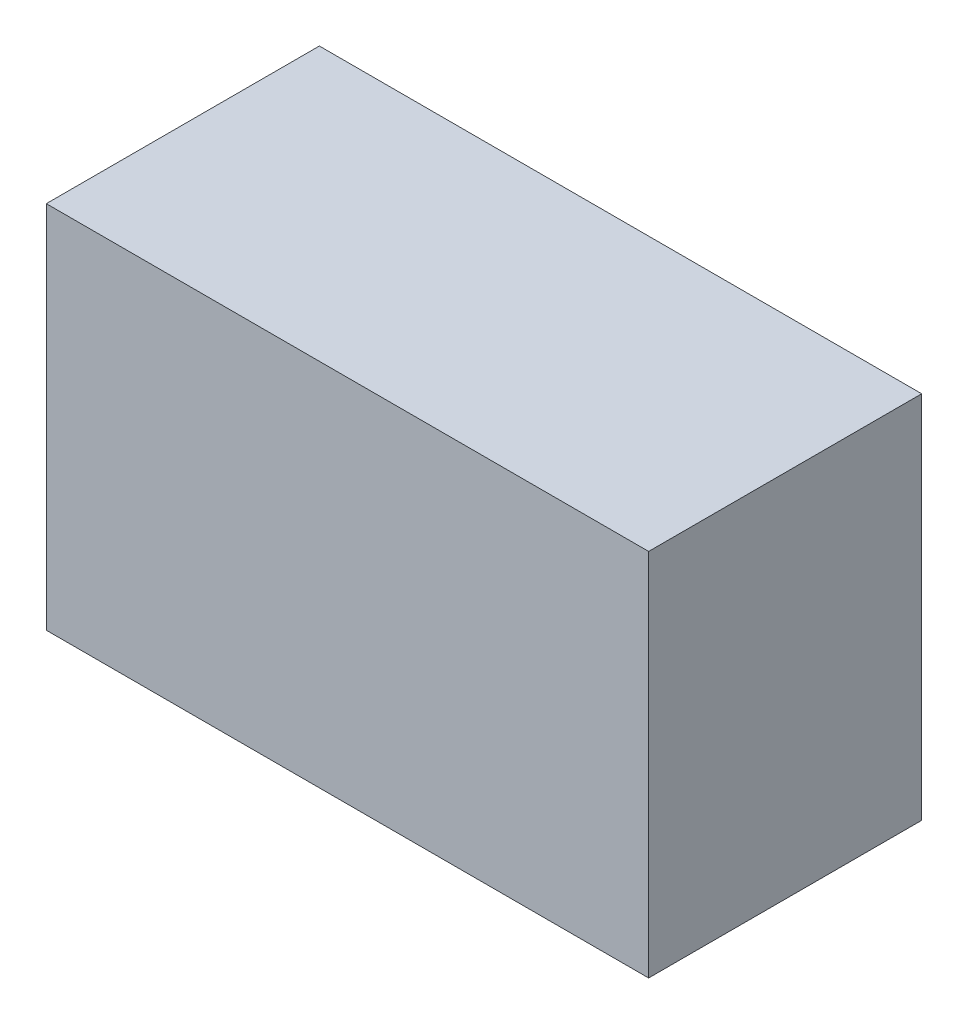
ISO-10303-21;
HEADER;
FILE_DESCRIPTION(('STEP AP214'),'2;1');
FILE_NAME('part.step','',(''),(''),'','','');
FILE_SCHEMA(('AUTOMOTIVE_DESIGN { 1 0 10303 214 1 1 1 1 }'));
ENDSEC;
DATA;
#1=APPLICATION_CONTEXT('core data for automotive mechanical design processes');
#2=APPLICATION_PROTOCOL_DEFINITION('international standard','automotive_design',2000,#1);
#3=PRODUCT_CONTEXT('',#1,'mechanical');
#4=PRODUCT('Part','Part','',(#3));
#5=PRODUCT_RELATED_PRODUCT_CATEGORY('part','',(#4));
#6=PRODUCT_DEFINITION_FORMATION('','',#4);
#7=PRODUCT_DEFINITION_CONTEXT('part definition',#1,'design');
#8=PRODUCT_DEFINITION('design','',#6,#7);
#9=PRODUCT_DEFINITION_SHAPE('','',#8);
#10=(LENGTH_UNIT() NAMED_UNIT(*) SI_UNIT(.MILLI.,.METRE.));
#11=(NAMED_UNIT(*) PLANE_ANGLE_UNIT() SI_UNIT($,.RADIAN.));
#12=(NAMED_UNIT(*) SI_UNIT($,.STERADIAN.) SOLID_ANGLE_UNIT());
#13=UNCERTAINTY_MEASURE_WITH_UNIT(LENGTH_MEASURE(1.E-05),#10,'distance_accuracy_value','');
#14=(GEOMETRIC_REPRESENTATION_CONTEXT(3) GLOBAL_UNCERTAINTY_ASSIGNED_CONTEXT((#13)) GLOBAL_UNIT_ASSIGNED_CONTEXT((#10,
#11,#12)) REPRESENTATION_CONTEXT('',''));
#15=CARTESIAN_POINT('',(0.,0.,0.));
#16=DIRECTION('',(0.,0.,1.));
#17=DIRECTION('',(1.,0.,0.));
#18=AXIS2_PLACEMENT_3D('',#15,#16,#17);
#19=CARTESIAN_POINT('',(37.5,46.,17.));
#20=DIRECTION('',(-1.,0.,0.));
#21=DIRECTION('',(0.,0.,1.));
#22=AXIS2_PLACEMENT_3D('',#19,#20,#21);
#23=PLANE('',#22);
#24=DIRECTION('',(0.,0.,-1.));
#25=VECTOR('',#24,1.);
#26=CARTESIAN_POINT('',(37.5,0.,17.));
#27=LINE('',#26,#25);
#28=CARTESIAN_POINT('',(37.5,0.,17.));
#29=VERTEX_POINT('',#28);
#30=CARTESIAN_POINT('',(37.5,0.,-17.));
#31=VERTEX_POINT('',#30);
#32=EDGE_CURVE('E97',#29,#31,#27,.T.);
#33=ORIENTED_EDGE('',*,*,#32,.T.);
#34=DIRECTION('',(0.,-1.,0.));
#35=VECTOR('',#34,1.);
#36=CARTESIAN_POINT('',(37.5,46.,-17.));
#37=LINE('',#36,#35);
#38=CARTESIAN_POINT('',(37.5,46.,-17.));
#39=VERTEX_POINT('',#38);
#40=EDGE_CURVE('E11',#39,#31,#37,.T.);
#41=ORIENTED_EDGE('',*,*,#40,.F.);
#42=DIRECTION('',(0.,0.,-1.));
#43=VECTOR('',#42,1.);
#44=CARTESIAN_POINT('',(37.5,46.,17.));
#45=LINE('',#44,#43);
#46=CARTESIAN_POINT('',(37.5,46.,17.));
#47=VERTEX_POINT('',#46);
#48=EDGE_CURVE('E85',#47,#39,#45,.T.);
#49=ORIENTED_EDGE('',*,*,#48,.F.);
#50=DIRECTION('',(0.,-1.,0.));
#51=VECTOR('',#50,1.);
#52=CARTESIAN_POINT('',(37.5,46.,17.));
#53=LINE('',#52,#51);
#54=EDGE_CURVE('E93',#47,#29,#53,.T.);
#55=ORIENTED_EDGE('',*,*,#54,.T.);
#56=EDGE_LOOP('',(#33,#41,#49,#55));
#57=FACE_BOUND('',#56,.T.);
#58=ADVANCED_FACE('F34',(#57),#23,.F.);
#59=CARTESIAN_POINT('',(-37.5,46.,-17.));
#60=DIRECTION('',(0.,0.,1.));
#61=DIRECTION('',(1.,0.,0.));
#62=AXIS2_PLACEMENT_3D('',#59,#60,#61);
#63=PLANE('',#62);
#64=DIRECTION('',(-1.,0.,0.));
#65=VECTOR('',#64,1.);
#66=CARTESIAN_POINT('',(-37.5,0.,-17.));
#67=LINE('',#66,#65);
#68=CARTESIAN_POINT('',(-37.5,0.,-17.));
#69=VERTEX_POINT('',#68);
#70=EDGE_CURVE('E89',#31,#69,#67,.T.);
#71=ORIENTED_EDGE('',*,*,#70,.T.);
#72=DIRECTION('',(0.,-1.,0.));
#73=VECTOR('',#72,1.);
#74=CARTESIAN_POINT('',(-37.5,46.,-17.));
#75=LINE('',#74,#73);
#76=CARTESIAN_POINT('',(-37.5,46.,-17.));
#77=VERTEX_POINT('',#76);
#78=EDGE_CURVE('E42',#77,#69,#75,.T.);
#79=ORIENTED_EDGE('',*,*,#78,.F.);
#80=DIRECTION('',(-1.,0.,0.));
#81=VECTOR('',#80,1.);
#82=CARTESIAN_POINT('',(-37.5,46.,-17.));
#83=LINE('',#82,#81);
#84=EDGE_CURVE('E80',#39,#77,#83,.T.);
#85=ORIENTED_EDGE('',*,*,#84,.F.);
#86=ORIENTED_EDGE('',*,*,#40,.T.);
#87=EDGE_LOOP('',(#71,#79,#85,#86));
#88=FACE_BOUND('',#87,.T.);
#89=ADVANCED_FACE('F88',(#88),#63,.F.);
#90=CARTESIAN_POINT('',(-37.5,46.,17.));
#91=DIRECTION('',(1.,0.,0.));
#92=DIRECTION('',(0.,0.,-1.));
#93=AXIS2_PLACEMENT_3D('',#90,#91,#92);
#94=PLANE('',#93);
#95=DIRECTION('',(0.,0.,1.));
#96=VECTOR('',#95,1.);
#97=CARTESIAN_POINT('',(-37.5,0.,17.));
#98=LINE('',#97,#96);
#99=CARTESIAN_POINT('',(-37.5,0.,17.));
#100=VERTEX_POINT('',#99);
#101=EDGE_CURVE('E67',#69,#100,#98,.T.);
#102=ORIENTED_EDGE('',*,*,#101,.T.);
#103=DIRECTION('',(0.,-1.,0.));
#104=VECTOR('',#103,1.);
#105=CARTESIAN_POINT('',(-37.5,46.,17.));
#106=LINE('',#105,#104);
#107=CARTESIAN_POINT('',(-37.5,46.,17.));
#108=VERTEX_POINT('',#107);
#109=EDGE_CURVE('E90',#108,#100,#106,.T.);
#110=ORIENTED_EDGE('',*,*,#109,.F.);
#111=DIRECTION('',(0.,0.,1.));
#112=VECTOR('',#111,1.);
#113=CARTESIAN_POINT('',(-37.5,46.,17.));
#114=LINE('',#113,#112);
#115=EDGE_CURVE('E83',#77,#108,#114,.T.);
#116=ORIENTED_EDGE('',*,*,#115,.F.);
#117=ORIENTED_EDGE('',*,*,#78,.T.);
#118=EDGE_LOOP('',(#102,#110,#116,#117));
#119=FACE_BOUND('',#118,.T.);
#120=ADVANCED_FACE('F91',(#119),#94,.F.);
#121=CARTESIAN_POINT('',(-37.5,46.,17.));
#122=DIRECTION('',(0.,0.,-1.));
#123=DIRECTION('',(-1.,0.,0.));
#124=AXIS2_PLACEMENT_3D('',#121,#122,#123);
#125=PLANE('',#124);
#126=DIRECTION('',(1.,0.,0.));
#127=VECTOR('',#126,1.);
#128=CARTESIAN_POINT('',(-37.5,0.,17.));
#129=LINE('',#128,#127);
#130=EDGE_CURVE('E73',#100,#29,#129,.T.);
#131=ORIENTED_EDGE('',*,*,#130,.T.);
#132=ORIENTED_EDGE('',*,*,#54,.F.);
#133=DIRECTION('',(1.,0.,0.));
#134=VECTOR('',#133,1.);
#135=CARTESIAN_POINT('',(-37.5,46.,17.));
#136=LINE('',#135,#134);
#137=EDGE_CURVE('E50',#108,#47,#136,.T.);
#138=ORIENTED_EDGE('',*,*,#137,.F.);
#139=ORIENTED_EDGE('',*,*,#109,.T.);
#140=EDGE_LOOP('',(#131,#132,#138,#139));
#141=FACE_BOUND('',#140,.T.);
#142=ADVANCED_FACE('F104',(#141),#125,.F.);
#143=CARTESIAN_POINT('',(0.,46.,0.));
#144=DIRECTION('',(0.,-1.,0.));
#145=DIRECTION('',(0.,0.,-1.));
#146=AXIS2_PLACEMENT_3D('',#143,#144,#145);
#147=PLANE('',#146);
#148=ORIENTED_EDGE('',*,*,#48,.T.);
#149=ORIENTED_EDGE('',*,*,#84,.T.);
#150=ORIENTED_EDGE('',*,*,#115,.T.);
#151=ORIENTED_EDGE('',*,*,#137,.T.);
#152=EDGE_LOOP('',(#148,#149,#150,#151));
#153=FACE_BOUND('',#152,.T.);
#154=ADVANCED_FACE('F81',(#153),#147,.F.);
#155=CARTESIAN_POINT('',(0.,0.,0.));
#156=DIRECTION('',(0.,-1.,0.));
#157=DIRECTION('',(0.,0.,-1.));
#158=AXIS2_PLACEMENT_3D('',#155,#156,#157);
#159=PLANE('',#158);
#160=ORIENTED_EDGE('',*,*,#32,.F.);
#161=ORIENTED_EDGE('',*,*,#130,.F.);
#162=ORIENTED_EDGE('',*,*,#101,.F.);
#163=ORIENTED_EDGE('',*,*,#70,.F.);
#164=EDGE_LOOP('',(#160,#161,#162,#163));
#165=FACE_BOUND('',#164,.T.);
#166=ADVANCED_FACE('F107',(#165),#159,.T.);
#167=CLOSED_SHELL('',(#58,#89,#120,#142,#154,#166));
#168=MANIFOLD_SOLID_BREP('B2',#167);
#169=ADVANCED_BREP_SHAPE_REPRESENTATION('',(#18,#168),#14);
#170=SHAPE_DEFINITION_REPRESENTATION(#9,#169);
ENDSEC;
END-ISO-10303-21;
